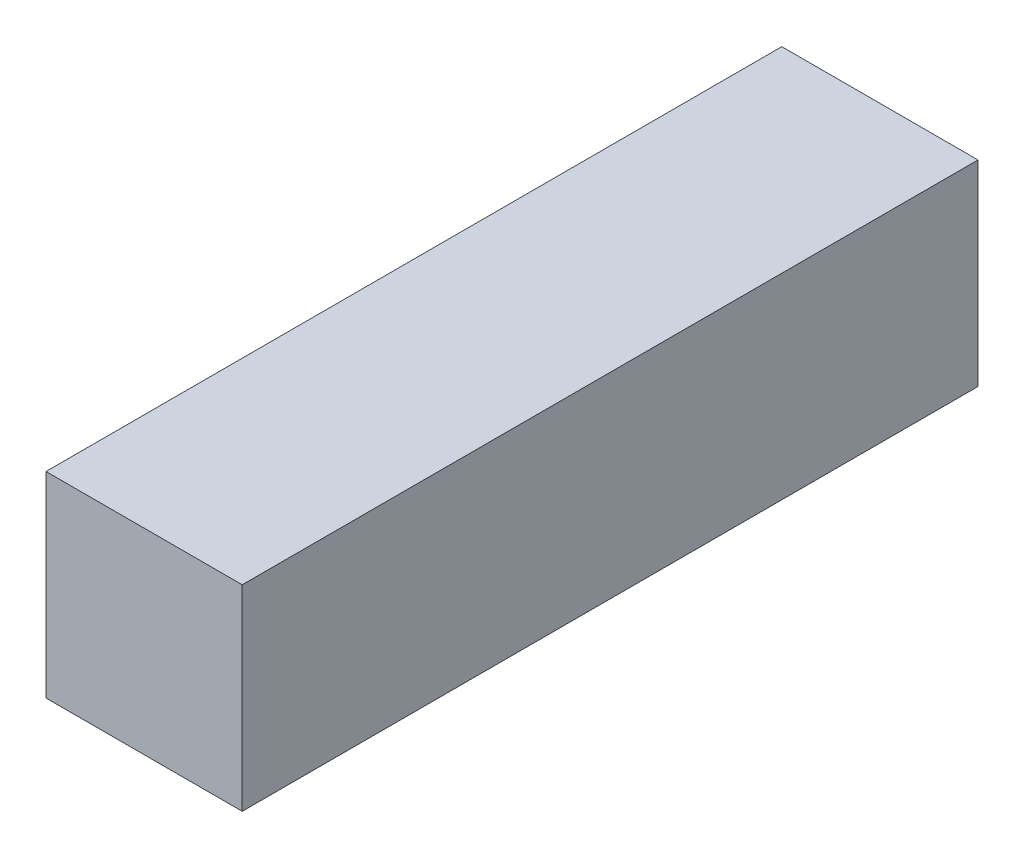
ISO-10303-21;
HEADER;
FILE_DESCRIPTION(('STEP AP214'),'2;1');
FILE_NAME('part.step','',(''),(''),'','','');
FILE_SCHEMA(('AUTOMOTIVE_DESIGN { 1 0 10303 214 1 1 1 1 }'));
ENDSEC;
DATA;
#1=APPLICATION_CONTEXT('core data for automotive mechanical design processes');
#2=APPLICATION_PROTOCOL_DEFINITION('international standard','automotive_design',2000,#1);
#3=PRODUCT_CONTEXT('',#1,'mechanical');
#4=PRODUCT('Part','Part','',(#3));
#5=PRODUCT_RELATED_PRODUCT_CATEGORY('part','',(#4));
#6=PRODUCT_DEFINITION_FORMATION('','',#4);
#7=PRODUCT_DEFINITION_CONTEXT('part definition',#1,'design');
#8=PRODUCT_DEFINITION('design','',#6,#7);
#9=PRODUCT_DEFINITION_SHAPE('','',#8);
#10=(LENGTH_UNIT() NAMED_UNIT(*) SI_UNIT(.MILLI.,.METRE.));
#11=(NAMED_UNIT(*) PLANE_ANGLE_UNIT() SI_UNIT($,.RADIAN.));
#12=(NAMED_UNIT(*) SI_UNIT($,.STERADIAN.) SOLID_ANGLE_UNIT());
#13=UNCERTAINTY_MEASURE_WITH_UNIT(LENGTH_MEASURE(1.E-05),#10,'distance_accuracy_value','');
#14=(GEOMETRIC_REPRESENTATION_CONTEXT(3) GLOBAL_UNCERTAINTY_ASSIGNED_CONTEXT((#13)) GLOBAL_UNIT_ASSIGNED_CONTEXT((#10,
#11,#12)) REPRESENTATION_CONTEXT('',''));
#15=CARTESIAN_POINT('',(0.,0.,0.));
#16=DIRECTION('',(0.,0.,1.));
#17=DIRECTION('',(1.,0.,0.));
#18=AXIS2_PLACEMENT_3D('',#15,#16,#17);
#19=CARTESIAN_POINT('',(10.16,-10.16,38.1));
#20=DIRECTION('',(-1.,0.,0.));
#21=DIRECTION('',(0.,0.,1.));
#22=AXIS2_PLACEMENT_3D('',#19,#20,#21);
#23=PLANE('',#22);
#24=DIRECTION('',(0.,1.,0.));
#25=VECTOR('',#24,1.);
#26=CARTESIAN_POINT('',(10.16,-10.16,-38.1));
#27=LINE('',#26,#25);
#28=CARTESIAN_POINT('',(10.16,-10.16,-38.1));
#29=VERTEX_POINT('',#28);
#30=CARTESIAN_POINT('',(10.16,10.16,-38.1));
#31=VERTEX_POINT('',#30);
#32=EDGE_CURVE('E102',#29,#31,#27,.T.);
#33=ORIENTED_EDGE('',*,*,#32,.T.);
#34=DIRECTION('',(0.,0.,-1.));
#35=VECTOR('',#34,1.);
#36=CARTESIAN_POINT('',(10.16,10.16,38.1));
#37=LINE('',#36,#35);
#38=CARTESIAN_POINT('',(10.16,10.16,38.1));
#39=VERTEX_POINT('',#38);
#40=EDGE_CURVE('E11',#39,#31,#37,.T.);
#41=ORIENTED_EDGE('',*,*,#40,.F.);
#42=DIRECTION('',(0.,1.,0.));
#43=VECTOR('',#42,1.);
#44=CARTESIAN_POINT('',(10.16,-10.16,38.1));
#45=LINE('',#44,#43);
#46=CARTESIAN_POINT('',(10.16,-10.16,38.1));
#47=VERTEX_POINT('',#46);
#48=EDGE_CURVE('E90',#47,#39,#45,.T.);
#49=ORIENTED_EDGE('',*,*,#48,.F.);
#50=DIRECTION('',(0.,0.,-1.));
#51=VECTOR('',#50,1.);
#52=CARTESIAN_POINT('',(10.16,-10.16,38.1));
#53=LINE('',#52,#51);
#54=EDGE_CURVE('E98',#47,#29,#53,.T.);
#55=ORIENTED_EDGE('',*,*,#54,.T.);
#56=EDGE_LOOP('',(#33,#41,#49,#55));
#57=FACE_BOUND('',#56,.T.);
#58=ADVANCED_FACE('F39',(#57),#23,.F.);
#59=CARTESIAN_POINT('',(-10.16,10.16,38.1));
#60=DIRECTION('',(0.,-1.,0.));
#61=DIRECTION('',(0.,0.,-1.));
#62=AXIS2_PLACEMENT_3D('',#59,#60,#61);
#63=PLANE('',#62);
#64=DIRECTION('',(-1.,0.,0.));
#65=VECTOR('',#64,1.);
#66=CARTESIAN_POINT('',(-10.16,10.16,-38.1));
#67=LINE('',#66,#65);
#68=CARTESIAN_POINT('',(-10.16,10.16,-38.1));
#69=VERTEX_POINT('',#68);
#70=EDGE_CURVE('E94',#31,#69,#67,.T.);
#71=ORIENTED_EDGE('',*,*,#70,.T.);
#72=DIRECTION('',(0.,0.,-1.));
#73=VECTOR('',#72,1.);
#74=CARTESIAN_POINT('',(-10.16,10.16,38.1));
#75=LINE('',#74,#73);
#76=CARTESIAN_POINT('',(-10.16,10.16,38.1));
#77=VERTEX_POINT('',#76);
#78=EDGE_CURVE('E47',#77,#69,#75,.T.);
#79=ORIENTED_EDGE('',*,*,#78,.F.);
#80=DIRECTION('',(-1.,0.,0.));
#81=VECTOR('',#80,1.);
#82=CARTESIAN_POINT('',(-10.16,10.16,38.1));
#83=LINE('',#82,#81);
#84=EDGE_CURVE('E85',#39,#77,#83,.T.);
#85=ORIENTED_EDGE('',*,*,#84,.F.);
#86=ORIENTED_EDGE('',*,*,#40,.T.);
#87=EDGE_LOOP('',(#71,#79,#85,#86));
#88=FACE_BOUND('',#87,.T.);
#89=ADVANCED_FACE('F93',(#88),#63,.F.);
#90=CARTESIAN_POINT('',(-10.16,-10.16,38.1));
#91=DIRECTION('',(1.,0.,0.));
#92=DIRECTION('',(0.,0.,-1.));
#93=AXIS2_PLACEMENT_3D('',#90,#91,#92);
#94=PLANE('',#93);
#95=DIRECTION('',(0.,-1.,0.));
#96=VECTOR('',#95,1.);
#97=CARTESIAN_POINT('',(-10.16,-10.16,-38.1));
#98=LINE('',#97,#96);
#99=CARTESIAN_POINT('',(-10.16,-10.16,-38.1));
#100=VERTEX_POINT('',#99);
#101=EDGE_CURVE('E72',#69,#100,#98,.T.);
#102=ORIENTED_EDGE('',*,*,#101,.T.);
#103=DIRECTION('',(0.,0.,-1.));
#104=VECTOR('',#103,1.);
#105=CARTESIAN_POINT('',(-10.16,-10.16,38.1));
#106=LINE('',#105,#104);
#107=CARTESIAN_POINT('',(-10.16,-10.16,38.1));
#108=VERTEX_POINT('',#107);
#109=EDGE_CURVE('E95',#108,#100,#106,.T.);
#110=ORIENTED_EDGE('',*,*,#109,.F.);
#111=DIRECTION('',(0.,-1.,0.));
#112=VECTOR('',#111,1.);
#113=CARTESIAN_POINT('',(-10.16,-10.16,38.1));
#114=LINE('',#113,#112);
#115=EDGE_CURVE('E88',#77,#108,#114,.T.);
#116=ORIENTED_EDGE('',*,*,#115,.F.);
#117=ORIENTED_EDGE('',*,*,#78,.T.);
#118=EDGE_LOOP('',(#102,#110,#116,#117));
#119=FACE_BOUND('',#118,.T.);
#120=ADVANCED_FACE('F96',(#119),#94,.F.);
#121=CARTESIAN_POINT('',(-10.16,-10.16,38.1));
#122=DIRECTION('',(0.,1.,0.));
#123=DIRECTION('',(0.,0.,1.));
#124=AXIS2_PLACEMENT_3D('',#121,#122,#123);
#125=PLANE('',#124);
#126=DIRECTION('',(1.,0.,0.));
#127=VECTOR('',#126,1.);
#128=CARTESIAN_POINT('',(-10.16,-10.16,-38.1));
#129=LINE('',#128,#127);
#130=EDGE_CURVE('E78',#100,#29,#129,.T.);
#131=ORIENTED_EDGE('',*,*,#130,.T.);
#132=ORIENTED_EDGE('',*,*,#54,.F.);
#133=DIRECTION('',(1.,0.,0.));
#134=VECTOR('',#133,1.);
#135=CARTESIAN_POINT('',(-10.16,-10.16,38.1));
#136=LINE('',#135,#134);
#137=EDGE_CURVE('E55',#108,#47,#136,.T.);
#138=ORIENTED_EDGE('',*,*,#137,.F.);
#139=ORIENTED_EDGE('',*,*,#109,.T.);
#140=EDGE_LOOP('',(#131,#132,#138,#139));
#141=FACE_BOUND('',#140,.T.);
#142=ADVANCED_FACE('F109',(#141),#125,.F.);
#143=CARTESIAN_POINT('',(0.,0.,38.1));
#144=DIRECTION('',(0.,0.,-1.));
#145=DIRECTION('',(-1.,0.,0.));
#146=AXIS2_PLACEMENT_3D('',#143,#144,#145);
#147=PLANE('',#146);
#148=ORIENTED_EDGE('',*,*,#48,.T.);
#149=ORIENTED_EDGE('',*,*,#84,.T.);
#150=ORIENTED_EDGE('',*,*,#115,.T.);
#151=ORIENTED_EDGE('',*,*,#137,.T.);
#152=EDGE_LOOP('',(#148,#149,#150,#151));
#153=FACE_BOUND('',#152,.T.);
#154=ADVANCED_FACE('F86',(#153),#147,.F.);
#155=CARTESIAN_POINT('',(0.,0.,-38.1));
#156=DIRECTION('',(0.,0.,-1.));
#157=DIRECTION('',(-1.,0.,0.));
#158=AXIS2_PLACEMENT_3D('',#155,#156,#157);
#159=PLANE('',#158);
#160=ORIENTED_EDGE('',*,*,#32,.F.);
#161=ORIENTED_EDGE('',*,*,#130,.F.);
#162=ORIENTED_EDGE('',*,*,#101,.F.);
#163=ORIENTED_EDGE('',*,*,#70,.F.);
#164=EDGE_LOOP('',(#160,#161,#162,#163));
#165=FACE_BOUND('',#164,.T.);
#166=ADVANCED_FACE('F112',(#165),#159,.T.);
#167=CLOSED_SHELL('',(#58,#89,#120,#142,#154,#166));
#168=MANIFOLD_SOLID_BREP('B2',#167);
#169=ADVANCED_BREP_SHAPE_REPRESENTATION('',(#18,#168),#14);
#170=SHAPE_DEFINITION_REPRESENTATION(#9,#169);
ENDSEC;
END-ISO-10303-21;
